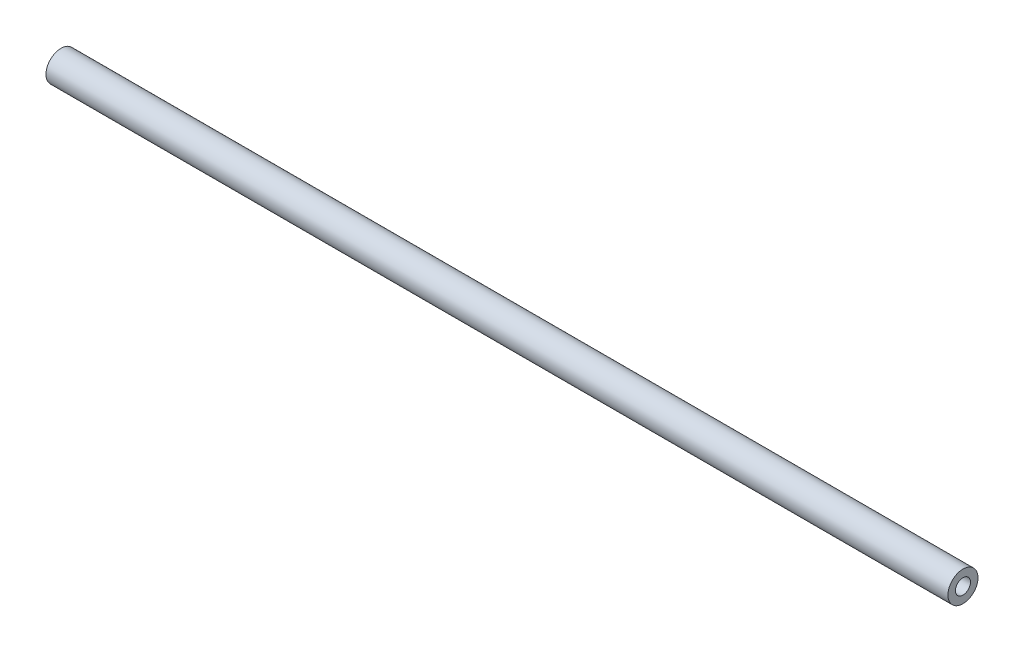
ISO-10303-21;
HEADER;
FILE_DESCRIPTION(('STEP AP214'),'2;1');
FILE_NAME('part.step','',(''),(''),'','','');
FILE_SCHEMA(('AUTOMOTIVE_DESIGN { 1 0 10303 214 1 1 1 1 }'));
ENDSEC;
DATA;
#1=APPLICATION_CONTEXT('core data for automotive mechanical design processes');
#2=APPLICATION_PROTOCOL_DEFINITION('international standard','automotive_design',2000,#1);
#3=PRODUCT_CONTEXT('',#1,'mechanical');
#4=PRODUCT('Part','Part','',(#3));
#5=PRODUCT_RELATED_PRODUCT_CATEGORY('part','',(#4));
#6=PRODUCT_DEFINITION_FORMATION('','',#4);
#7=PRODUCT_DEFINITION_CONTEXT('part definition',#1,'design');
#8=PRODUCT_DEFINITION('design','',#6,#7);
#9=PRODUCT_DEFINITION_SHAPE('','',#8);
#10=(LENGTH_UNIT() NAMED_UNIT(*) SI_UNIT(.MILLI.,.METRE.));
#11=(NAMED_UNIT(*) PLANE_ANGLE_UNIT() SI_UNIT($,.RADIAN.));
#12=(NAMED_UNIT(*) SI_UNIT($,.STERADIAN.) SOLID_ANGLE_UNIT());
#13=UNCERTAINTY_MEASURE_WITH_UNIT(LENGTH_MEASURE(1.E-05),#10,'distance_accuracy_value','');
#14=(GEOMETRIC_REPRESENTATION_CONTEXT(3) GLOBAL_UNCERTAINTY_ASSIGNED_CONTEXT((#13)) GLOBAL_UNIT_ASSIGNED_CONTEXT((#10,
#11,#12)) REPRESENTATION_CONTEXT('',''));
#15=CARTESIAN_POINT('',(0.,0.,0.));
#16=DIRECTION('',(0.,0.,1.));
#17=DIRECTION('',(1.,0.,0.));
#18=AXIS2_PLACEMENT_3D('',#15,#16,#17);
#19=CARTESIAN_POINT('',(381.,0.,0.));
#20=DIRECTION('',(-1.,0.,0.));
#21=DIRECTION('',(0.,0.,1.));
#22=AXIS2_PLACEMENT_3D('',#19,#20,#21);
#23=CYLINDRICAL_SURFACE('',#22,6.35);
#24=CARTESIAN_POINT('',(381.,0.,0.));
#25=DIRECTION('',(1.,0.,0.));
#26=DIRECTION('',(0.,0.,-1.));
#27=AXIS2_PLACEMENT_3D('',#24,#25,#26);
#28=CIRCLE('',#27,6.35);
#29=CARTESIAN_POINT('',(381.,0.,-6.35));
#30=VERTEX_POINT('',#29);
#31=EDGE_CURVE('E10',#30,#30,#28,.T.);
#32=ORIENTED_EDGE('',*,*,#31,.F.);
#33=EDGE_LOOP('',(#32));
#34=FACE_BOUND('',#33,.T.);
#35=CARTESIAN_POINT('',(0.,0.,0.));
#36=DIRECTION('',(1.,0.,0.));
#37=DIRECTION('',(0.,0.,-1.));
#38=AXIS2_PLACEMENT_3D('',#35,#36,#37);
#39=CIRCLE('',#38,6.35);
#40=CARTESIAN_POINT('',(0.,0.,-6.35));
#41=VERTEX_POINT('',#40);
#42=EDGE_CURVE('E33',#41,#41,#39,.T.);
#43=ORIENTED_EDGE('',*,*,#42,.T.);
#44=EDGE_LOOP('',(#43));
#45=FACE_BOUND('',#44,.T.);
#46=ADVANCED_FACE('F30',(#34,#45),#23,.T.);
#47=CARTESIAN_POINT('',(381.,0.,0.));
#48=DIRECTION('',(1.,0.,0.));
#49=DIRECTION('',(0.,0.,-1.));
#50=AXIS2_PLACEMENT_3D('',#47,#48,#49);
#51=PLANE('',#50);
#52=CARTESIAN_POINT('',(381.,0.,0.));
#53=DIRECTION('',(1.,0.,0.));
#54=DIRECTION('',(0.,0.,-1.));
#55=AXIS2_PLACEMENT_3D('',#52,#53,#54);
#56=CIRCLE('',#55,3.175);
#57=CARTESIAN_POINT('',(381.,0.,-3.175));
#58=VERTEX_POINT('',#57);
#59=EDGE_CURVE('E42',#58,#58,#56,.T.);
#60=ORIENTED_EDGE('',*,*,#59,.F.);
#61=EDGE_LOOP('',(#60));
#62=FACE_BOUND('',#61,.T.);
#63=ORIENTED_EDGE('',*,*,#31,.T.);
#64=EDGE_LOOP('',(#63));
#65=FACE_BOUND('',#64,.T.);
#66=ADVANCED_FACE('F57',(#62,#65),#51,.T.);
#67=CARTESIAN_POINT('',(0.,0.,0.));
#68=DIRECTION('',(1.,0.,0.));
#69=DIRECTION('',(0.,0.,-1.));
#70=AXIS2_PLACEMENT_3D('',#67,#68,#69);
#71=PLANE('',#70);
#72=CARTESIAN_POINT('',(0.,0.,0.));
#73=DIRECTION('',(1.,0.,0.));
#74=DIRECTION('',(0.,0.,-1.));
#75=AXIS2_PLACEMENT_3D('',#72,#73,#74);
#76=CIRCLE('',#75,3.175);
#77=CARTESIAN_POINT('',(0.,0.,-3.175));
#78=VERTEX_POINT('',#77);
#79=EDGE_CURVE('E40',#78,#78,#76,.T.);
#80=ORIENTED_EDGE('',*,*,#79,.T.);
#81=EDGE_LOOP('',(#80));
#82=FACE_BOUND('',#81,.T.);
#83=ORIENTED_EDGE('',*,*,#42,.F.);
#84=EDGE_LOOP('',(#83));
#85=FACE_BOUND('',#84,.T.);
#86=ADVANCED_FACE('F48',(#82,#85),#71,.F.);
#87=CARTESIAN_POINT('',(0.,0.,0.));
#88=DIRECTION('',(1.,0.,0.));
#89=DIRECTION('',(0.,0.,-1.));
#90=AXIS2_PLACEMENT_3D('',#87,#88,#89);
#91=CYLINDRICAL_SURFACE('',#90,3.175);
#92=ORIENTED_EDGE('',*,*,#79,.F.);
#93=EDGE_LOOP('',(#92));
#94=FACE_BOUND('',#93,.T.);
#95=ORIENTED_EDGE('',*,*,#59,.T.);
#96=EDGE_LOOP('',(#95));
#97=FACE_BOUND('',#96,.T.);
#98=ADVANCED_FACE('F51',(#94,#97),#91,.F.);
#99=CLOSED_SHELL('',(#46,#66,#86,#98));
#100=MANIFOLD_SOLID_BREP('B2',#99);
#101=ADVANCED_BREP_SHAPE_REPRESENTATION('',(#18,#100),#14);
#102=SHAPE_DEFINITION_REPRESENTATION(#9,#101);
ENDSEC;
END-ISO-10303-21;
